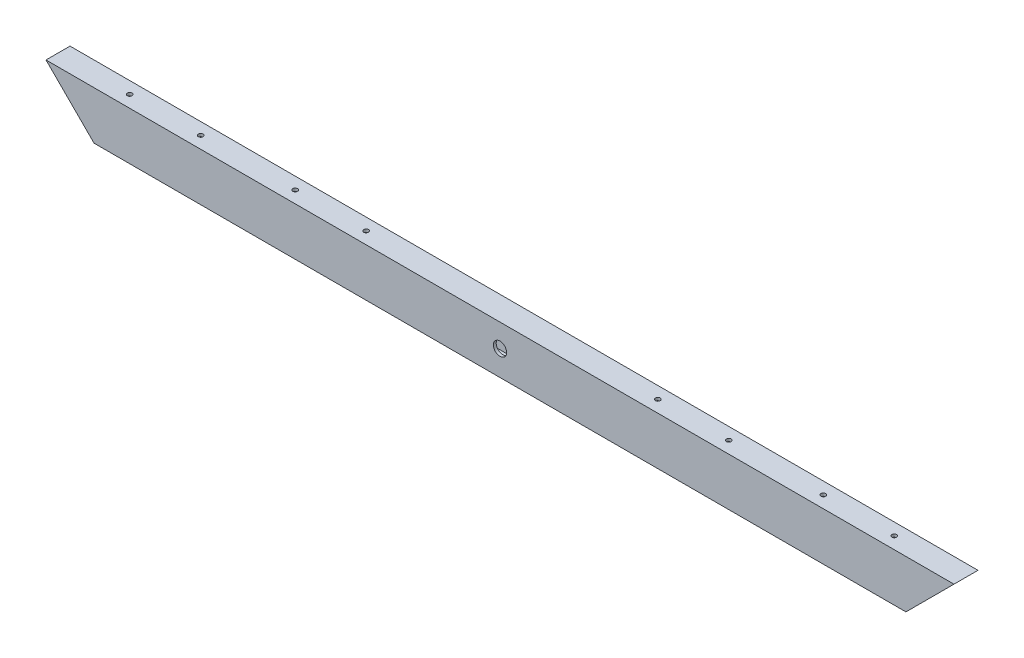
ISO-10303-21;
HEADER;
FILE_DESCRIPTION(('STEP AP214'),'2;1');
FILE_NAME('part.step','',(''),(''),'','','');
FILE_SCHEMA(('AUTOMOTIVE_DESIGN { 1 0 10303 214 1 1 1 1 }'));
ENDSEC;
DATA;
#1=APPLICATION_CONTEXT('core data for automotive mechanical design processes');
#2=APPLICATION_PROTOCOL_DEFINITION('international standard','automotive_design',2000,#1);
#3=PRODUCT_CONTEXT('',#1,'mechanical');
#4=PRODUCT('Part','Part','',(#3));
#5=PRODUCT_RELATED_PRODUCT_CATEGORY('part','',(#4));
#6=PRODUCT_DEFINITION_FORMATION('','',#4);
#7=PRODUCT_DEFINITION_CONTEXT('part definition',#1,'design');
#8=PRODUCT_DEFINITION('design','',#6,#7);
#9=PRODUCT_DEFINITION_SHAPE('','',#8);
#10=(LENGTH_UNIT() NAMED_UNIT(*) SI_UNIT(.MILLI.,.METRE.));
#11=(NAMED_UNIT(*) PLANE_ANGLE_UNIT() SI_UNIT($,.RADIAN.));
#12=(NAMED_UNIT(*) SI_UNIT($,.STERADIAN.) SOLID_ANGLE_UNIT());
#13=UNCERTAINTY_MEASURE_WITH_UNIT(LENGTH_MEASURE(1.E-05),#10,'distance_accuracy_value','');
#14=(GEOMETRIC_REPRESENTATION_CONTEXT(3) GLOBAL_UNCERTAINTY_ASSIGNED_CONTEXT((#13)) GLOBAL_UNIT_ASSIGNED_CONTEXT((#10,
#11,#12)) REPRESENTATION_CONTEXT('',''));
#15=CARTESIAN_POINT('',(0.,0.,0.));
#16=DIRECTION('',(0.,0.,1.));
#17=DIRECTION('',(1.,0.,0.));
#18=AXIS2_PLACEMENT_3D('',#15,#16,#17);
#19=CARTESIAN_POINT('',(909.199999999999,50.8000000000002,25.4));
#20=DIRECTION('',(-0.707106781186554,0.707106781186541,0.));
#21=DIRECTION('',(-0.707106781186541,-0.707106781186554,0.));
#22=AXIS2_PLACEMENT_3D('',#19,#20,#21);
#23=PLANE('',#22);
#24=DIRECTION('',(0.707106781186541,0.707106781186554,0.));
#25=VECTOR('',#24,1.);
#26=CARTESIAN_POINT('',(909.199999999999,50.8000000000002,0.));
#27=LINE('',#26,#25);
#28=CARTESIAN_POINT('',(858.399999999999,0.,0.));
#29=VERTEX_POINT('',#28);
#30=CARTESIAN_POINT('',(909.199999999999,50.8000000000002,0.));
#31=VERTEX_POINT('',#30);
#32=EDGE_CURVE('E138',#29,#31,#27,.T.);
#33=ORIENTED_EDGE('',*,*,#32,.T.);
#34=DIRECTION('',(0.,0.,-1.));
#35=VECTOR('',#34,1.);
#36=CARTESIAN_POINT('',(909.199999999999,50.8000000000002,25.4));
#37=LINE('',#36,#35);
#38=CARTESIAN_POINT('',(909.199999999999,50.8000000000002,25.4));
#39=VERTEX_POINT('',#38);
#40=EDGE_CURVE('E167',#39,#31,#37,.T.);
#41=ORIENTED_EDGE('',*,*,#40,.F.);
#42=DIRECTION('',(0.707106781186541,0.707106781186554,0.));
#43=VECTOR('',#42,1.);
#44=CARTESIAN_POINT('',(909.199999999999,50.8000000000002,25.4));
#45=LINE('',#44,#43);
#46=CARTESIAN_POINT('',(858.399999999999,0.,25.4));
#47=VERTEX_POINT('',#46);
#48=EDGE_CURVE('E141',#47,#39,#45,.T.);
#49=ORIENTED_EDGE('',*,*,#48,.F.);
#50=DIRECTION('',(0.,0.,-1.));
#51=VECTOR('',#50,1.);
#52=CARTESIAN_POINT('',(858.399999999999,0.,25.4));
#53=LINE('',#52,#51);
#54=EDGE_CURVE('E151',#47,#29,#53,.T.);
#55=ORIENTED_EDGE('',*,*,#54,.T.);
#56=EDGE_LOOP('',(#33,#41,#49,#55));
#57=FACE_BOUND('',#56,.T.);
#58=DIRECTION('',(-0.707106781186541,-0.707106781186554,0.));
#59=VECTOR('',#58,1.);
#60=CARTESIAN_POINT('',(909.199999999999,50.8000000000002,22.4));
#61=LINE('',#60,#59);
#62=CARTESIAN_POINT('',(906.199999999999,47.8000000000002,22.4));
#63=VERTEX_POINT('',#62);
#64=CARTESIAN_POINT('',(861.399999999999,3.00000000000001,22.4));
#65=VERTEX_POINT('',#64);
#66=EDGE_CURVE('E132',#63,#65,#61,.T.);
#67=ORIENTED_EDGE('',*,*,#66,.F.);
#68=DIRECTION('',(0.,0.,1.));
#69=VECTOR('',#68,1.);
#70=CARTESIAN_POINT('',(906.199999999999,47.8000000000002,25.4));
#71=LINE('',#70,#69);
#72=CARTESIAN_POINT('',(906.199999999999,47.8000000000002,3.));
#73=VERTEX_POINT('',#72);
#74=EDGE_CURVE('E113',#73,#63,#71,.T.);
#75=ORIENTED_EDGE('',*,*,#74,.F.);
#76=DIRECTION('',(0.707106781186541,0.707106781186554,0.));
#77=VECTOR('',#76,1.);
#78=CARTESIAN_POINT('',(909.199999999999,50.8000000000002,3.));
#79=LINE('',#78,#77);
#80=CARTESIAN_POINT('',(861.399999999999,2.99999999999999,2.99999999999999));
#81=VERTEX_POINT('',#80);
#82=EDGE_CURVE('E117',#81,#73,#79,.T.);
#83=ORIENTED_EDGE('',*,*,#82,.F.);
#84=DIRECTION('',(0.,0.,-1.));
#85=VECTOR('',#84,1.);
#86=CARTESIAN_POINT('',(861.399999999999,3.00000000000001,25.4));
#87=LINE('',#86,#85);
#88=EDGE_CURVE('E102',#65,#81,#87,.T.);
#89=ORIENTED_EDGE('',*,*,#88,.F.);
#90=EDGE_LOOP('',(#67,#75,#83,#89));
#91=FACE_BOUND('',#90,.T.);
#92=ADVANCED_FACE('F37',(#57,#91),#23,.F.);
#93=CARTESIAN_POINT('',(-50.8000000000013,50.8,25.4));
#94=DIRECTION('',(0.707106781186539,0.707106781186556,0.));
#95=DIRECTION('',(-0.707106781186556,0.707106781186539,0.));
#96=AXIS2_PLACEMENT_3D('',#93,#94,#95);
#97=PLANE('',#96);
#98=DIRECTION('',(0.707106781186556,-0.707106781186539,0.));
#99=VECTOR('',#98,1.);
#100=CARTESIAN_POINT('',(-50.8000000000013,50.8,0.));
#101=LINE('',#100,#99);
#102=CARTESIAN_POINT('',(-50.8000000000013,50.8,0.));
#103=VERTEX_POINT('',#102);
#104=CARTESIAN_POINT('',(0.,0.,0.));
#105=VERTEX_POINT('',#104);
#106=EDGE_CURVE('E156',#103,#105,#101,.T.);
#107=ORIENTED_EDGE('',*,*,#106,.T.);
#108=DIRECTION('',(0.,0.,-1.));
#109=VECTOR('',#108,1.);
#110=CARTESIAN_POINT('',(0.,0.,25.4));
#111=LINE('',#110,#109);
#112=CARTESIAN_POINT('',(0.,0.,25.4));
#113=VERTEX_POINT('',#112);
#114=EDGE_CURVE('E161',#113,#105,#111,.T.);
#115=ORIENTED_EDGE('',*,*,#114,.F.);
#116=DIRECTION('',(0.707106781186556,-0.707106781186539,0.));
#117=VECTOR('',#116,1.);
#118=CARTESIAN_POINT('',(-50.8000000000013,50.8,25.4));
#119=LINE('',#118,#117);
#120=CARTESIAN_POINT('',(-50.8000000000013,50.8,25.4));
#121=VERTEX_POINT('',#120);
#122=EDGE_CURVE('E147',#121,#113,#119,.T.);
#123=ORIENTED_EDGE('',*,*,#122,.F.);
#124=DIRECTION('',(0.,0.,-1.));
#125=VECTOR('',#124,1.);
#126=CARTESIAN_POINT('',(-50.8000000000013,50.8,25.4));
#127=LINE('',#126,#125);
#128=EDGE_CURVE('E164',#121,#103,#127,.T.);
#129=ORIENTED_EDGE('',*,*,#128,.T.);
#130=EDGE_LOOP('',(#107,#115,#123,#129));
#131=FACE_BOUND('',#130,.T.);
#132=DIRECTION('',(-0.707106781186556,0.707106781186539,0.));
#133=VECTOR('',#132,1.);
#134=CARTESIAN_POINT('',(-50.8000000000013,50.8,22.4));
#135=LINE('',#134,#133);
#136=CARTESIAN_POINT('',(-3.00000000000011,3.00000000000001,22.4));
#137=VERTEX_POINT('',#136);
#138=CARTESIAN_POINT('',(-47.8000000000014,47.8000000000002,22.4));
#139=VERTEX_POINT('',#138);
#140=EDGE_CURVE('E125',#137,#139,#135,.T.);
#141=ORIENTED_EDGE('',*,*,#140,.F.);
#142=DIRECTION('',(0.,0.,1.));
#143=VECTOR('',#142,1.);
#144=CARTESIAN_POINT('',(-3.00000000000007,3.,25.4));
#145=LINE('',#144,#143);
#146=CARTESIAN_POINT('',(-3.0000000000001,3.00000000000002,2.99999999999999));
#147=VERTEX_POINT('',#146);
#148=EDGE_CURVE('E11',#147,#137,#145,.T.);
#149=ORIENTED_EDGE('',*,*,#148,.F.);
#150=DIRECTION('',(0.707106781186556,-0.707106781186539,0.));
#151=VECTOR('',#150,1.);
#152=CARTESIAN_POINT('',(-50.8000000000013,50.8,3.));
#153=LINE('',#152,#151);
#154=CARTESIAN_POINT('',(-47.8000000000014,47.8000000000002,3.));
#155=VERTEX_POINT('',#154);
#156=EDGE_CURVE('E120',#155,#147,#153,.T.);
#157=ORIENTED_EDGE('',*,*,#156,.F.);
#158=DIRECTION('',(0.,0.,-1.));
#159=VECTOR('',#158,1.);
#160=CARTESIAN_POINT('',(-47.8000000000014,47.8000000000002,25.4));
#161=LINE('',#160,#159);
#162=EDGE_CURVE('E45',#139,#155,#161,.T.);
#163=ORIENTED_EDGE('',*,*,#162,.F.);
#164=EDGE_LOOP('',(#141,#149,#157,#163));
#165=FACE_BOUND('',#164,.T.);
#166=ADVANCED_FACE('F219',(#131,#165),#97,.F.);
#167=CARTESIAN_POINT('',(429.199999999999,26.4000000000001,25.4));
#168=DIRECTION('',(0.,0.,-1.));
#169=DIRECTION('',(-1.,0.,0.));
#170=AXIS2_PLACEMENT_3D('',#167,#168,#169);
#171=CYLINDRICAL_SURFACE('',#170,6.99999999999999);
#172=CARTESIAN_POINT('',(429.199999999999,26.4000000000001,25.4));
#173=DIRECTION('',(0.,0.,1.));
#174=DIRECTION('',(1.,0.,0.));
#175=AXIS2_PLACEMENT_3D('',#172,#173,#174);
#176=CIRCLE('',#175,6.99999999999999);
#177=CARTESIAN_POINT('',(436.199999999999,26.4000000000001,25.4));
#178=VERTEX_POINT('',#177);
#179=EDGE_CURVE('E135',#178,#178,#176,.T.);
#180=ORIENTED_EDGE('',*,*,#179,.T.);
#181=EDGE_LOOP('',(#180));
#182=FACE_BOUND('',#181,.T.);
#183=CARTESIAN_POINT('',(429.199999999999,26.4000000000001,22.4));
#184=DIRECTION('',(0.,0.,-1.));
#185=DIRECTION('',(0.,1.,0.));
#186=AXIS2_PLACEMENT_3D('',#183,#184,#185);
#187=CIRCLE('',#186,6.99999999999999);
#188=CARTESIAN_POINT('',(429.199999999999,33.4000000000001,22.4));
#189=VERTEX_POINT('',#188);
#190=EDGE_CURVE('E122',#189,#189,#187,.T.);
#191=ORIENTED_EDGE('',*,*,#190,.T.);
#192=EDGE_LOOP('',(#191));
#193=FACE_BOUND('',#192,.T.);
#194=ADVANCED_FACE('F240',(#182,#193),#171,.F.);
#195=CARTESIAN_POINT('',(429.199999999999,26.4000000000001,0.));
#196=DIRECTION('',(0.,0.,1.));
#197=DIRECTION('',(1.,0.,0.));
#198=AXIS2_PLACEMENT_3D('',#195,#196,#197);
#199=CIRCLE('',#198,6.99999999999999);
#200=CARTESIAN_POINT('',(436.199999999999,26.4000000000001,0.));
#201=VERTEX_POINT('',#200);
#202=EDGE_CURVE('E112',#201,#201,#199,.T.);
#203=ORIENTED_EDGE('',*,*,#202,.F.);
#204=EDGE_LOOP('',(#203));
#205=FACE_BOUND('',#204,.T.);
#206=CARTESIAN_POINT('',(429.199999999999,26.4000000000001,3.));
#207=DIRECTION('',(0.,0.,1.));
#208=DIRECTION('',(0.,-1.,0.));
#209=AXIS2_PLACEMENT_3D('',#206,#207,#208);
#210=CIRCLE('',#209,6.99999999999999);
#211=CARTESIAN_POINT('',(429.199999999999,19.4000000000001,2.99999999999999));
#212=VERTEX_POINT('',#211);
#213=EDGE_CURVE('E127',#212,#212,#210,.T.);
#214=ORIENTED_EDGE('',*,*,#213,.T.);
#215=EDGE_LOOP('',(#214));
#216=FACE_BOUND('',#215,.T.);
#217=ADVANCED_FACE('F273',(#205,#216),#171,.F.);
#218=CARTESIAN_POINT('',(0.,0.,25.4));
#219=DIRECTION('',(0.,0.,1.));
#220=DIRECTION('',(1.,0.,0.));
#221=AXIS2_PLACEMENT_3D('',#218,#219,#220);
#222=PLANE('',#221);
#223=ORIENTED_EDGE('',*,*,#48,.T.);
#224=DIRECTION('',(-1.,0.,0.));
#225=VECTOR('',#224,1.);
#226=CARTESIAN_POINT('',(-50.8000000000013,50.8,25.4));
#227=LINE('',#226,#225);
#228=EDGE_CURVE('E144',#39,#121,#227,.T.);
#229=ORIENTED_EDGE('',*,*,#228,.T.);
#230=ORIENTED_EDGE('',*,*,#122,.T.);
#231=DIRECTION('',(1.,0.,0.));
#232=VECTOR('',#231,1.);
#233=CARTESIAN_POINT('',(0.,0.,25.4));
#234=LINE('',#233,#232);
#235=EDGE_CURVE('E149',#113,#47,#234,.T.);
#236=ORIENTED_EDGE('',*,*,#235,.T.);
#237=EDGE_LOOP('',(#223,#229,#230,#236));
#238=FACE_BOUND('',#237,.T.);
#239=ORIENTED_EDGE('',*,*,#179,.F.);
#240=EDGE_LOOP('',(#239));
#241=FACE_BOUND('',#240,.T.);
#242=ADVANCED_FACE('F257',(#238,#241),#222,.T.);
#243=CARTESIAN_POINT('',(0.,0.,0.));
#244=DIRECTION('',(0.,0.,1.));
#245=DIRECTION('',(1.,0.,0.));
#246=AXIS2_PLACEMENT_3D('',#243,#244,#245);
#247=PLANE('',#246);
#248=ORIENTED_EDGE('',*,*,#32,.F.);
#249=DIRECTION('',(1.,0.,0.));
#250=VECTOR('',#249,1.);
#251=CARTESIAN_POINT('',(0.,0.,0.));
#252=LINE('',#251,#250);
#253=EDGE_CURVE('E145',#105,#29,#252,.T.);
#254=ORIENTED_EDGE('',*,*,#253,.F.);
#255=ORIENTED_EDGE('',*,*,#106,.F.);
#256=DIRECTION('',(-1.,0.,0.));
#257=VECTOR('',#256,1.);
#258=CARTESIAN_POINT('',(-50.8000000000013,50.8,0.));
#259=LINE('',#258,#257);
#260=EDGE_CURVE('E154',#31,#103,#259,.T.);
#261=ORIENTED_EDGE('',*,*,#260,.F.);
#262=EDGE_LOOP('',(#248,#254,#255,#261));
#263=FACE_BOUND('',#262,.T.);
#264=ORIENTED_EDGE('',*,*,#202,.T.);
#265=EDGE_LOOP('',(#264));
#266=FACE_BOUND('',#265,.T.);
#267=ADVANCED_FACE('F249',(#263,#266),#247,.F.);
#268=CARTESIAN_POINT('',(-50.8000000000013,50.8,25.4));
#269=DIRECTION('',(0.,-1.,0.));
#270=DIRECTION('',(1.,0.,0.));
#271=AXIS2_PLACEMENT_3D('',#268,#269,#270);
#272=PLANE('',#271);
#273=CARTESIAN_POINT('',(24.9999999999987,50.8,12.7));
#274=DIRECTION('',(0.,-1.,0.));
#275=DIRECTION('',(1.,0.,0.));
#276=AXIS2_PLACEMENT_3D('',#273,#274,#275);
#277=CIRCLE('',#276,2.5);
#278=CARTESIAN_POINT('',(27.4999999999987,50.8,12.7));
#279=VERTEX_POINT('',#278);
#280=EDGE_CURVE('E210',#279,#279,#277,.F.);
#281=ORIENTED_EDGE('',*,*,#280,.F.);
#282=EDGE_LOOP('',(#281));
#283=FACE_BOUND('',#282,.T.);
#284=CARTESIAN_POINT('',(583.399999999999,50.8000000000002,12.7));
#285=DIRECTION('',(0.,-1.,0.));
#286=DIRECTION('',(1.,0.,0.));
#287=AXIS2_PLACEMENT_3D('',#284,#285,#286);
#288=CIRCLE('',#287,2.49999999999991);
#289=CARTESIAN_POINT('',(585.899999999999,50.8000000000002,12.7));
#290=VERTEX_POINT('',#289);
#291=EDGE_CURVE('E198',#290,#290,#288,.F.);
#292=ORIENTED_EDGE('',*,*,#291,.F.);
#293=EDGE_LOOP('',(#292));
#294=FACE_BOUND('',#293,.T.);
#295=CARTESIAN_POINT('',(658.399999999999,50.8000000000002,12.7));
#296=DIRECTION('',(0.,-1.,0.));
#297=DIRECTION('',(1.,0.,0.));
#298=AXIS2_PLACEMENT_3D('',#295,#296,#297);
#299=CIRCLE('',#298,2.49999999999991);
#300=CARTESIAN_POINT('',(660.899999999999,50.8000000000002,12.7));
#301=VERTEX_POINT('',#300);
#302=EDGE_CURVE('E195',#301,#301,#299,.F.);
#303=ORIENTED_EDGE('',*,*,#302,.F.);
#304=EDGE_LOOP('',(#303));
#305=FACE_BOUND('',#304,.T.);
#306=CARTESIAN_POINT('',(758.399999999999,50.8000000000002,12.7));
#307=DIRECTION('',(0.,-1.,0.));
#308=DIRECTION('',(1.,0.,0.));
#309=AXIS2_PLACEMENT_3D('',#306,#307,#308);
#310=CIRCLE('',#309,2.49999999999991);
#311=CARTESIAN_POINT('',(760.899999999999,50.8000000000002,12.7));
#312=VERTEX_POINT('',#311);
#313=EDGE_CURVE('E192',#312,#312,#310,.F.);
#314=ORIENTED_EDGE('',*,*,#313,.F.);
#315=EDGE_LOOP('',(#314));
#316=FACE_BOUND('',#315,.T.);
#317=CARTESIAN_POINT('',(833.399999999999,50.8000000000002,12.7));
#318=DIRECTION('',(0.,-1.,0.));
#319=DIRECTION('',(1.,0.,0.));
#320=AXIS2_PLACEMENT_3D('',#317,#318,#319);
#321=CIRCLE('',#320,2.49999999999991);
#322=CARTESIAN_POINT('',(835.899999999999,50.8000000000002,12.7));
#323=VERTEX_POINT('',#322);
#324=EDGE_CURVE('E188',#323,#323,#321,.F.);
#325=ORIENTED_EDGE('',*,*,#324,.F.);
#326=EDGE_LOOP('',(#325));
#327=FACE_BOUND('',#326,.T.);
#328=CARTESIAN_POINT('',(274.999999999999,50.8000000000001,12.7));
#329=DIRECTION('',(0.,-1.,0.));
#330=DIRECTION('',(1.,0.,0.));
#331=AXIS2_PLACEMENT_3D('',#328,#329,#330);
#332=CIRCLE('',#331,2.50000000000002);
#333=CARTESIAN_POINT('',(277.499999999999,50.8000000000001,12.7));
#334=VERTEX_POINT('',#333);
#335=EDGE_CURVE('E184',#334,#334,#332,.F.);
#336=ORIENTED_EDGE('',*,*,#335,.F.);
#337=EDGE_LOOP('',(#336));
#338=FACE_BOUND('',#337,.T.);
#339=CARTESIAN_POINT('',(199.999999999999,50.8000000000001,12.7));
#340=DIRECTION('',(0.,-1.,0.));
#341=DIRECTION('',(1.,0.,0.));
#342=AXIS2_PLACEMENT_3D('',#339,#340,#341);
#343=CIRCLE('',#342,2.5);
#344=CARTESIAN_POINT('',(202.499999999999,50.8000000000001,12.7));
#345=VERTEX_POINT('',#344);
#346=EDGE_CURVE('E180',#345,#345,#343,.F.);
#347=ORIENTED_EDGE('',*,*,#346,.F.);
#348=EDGE_LOOP('',(#347));
#349=FACE_BOUND('',#348,.T.);
#350=CARTESIAN_POINT('',(99.9999999999987,50.8,12.7));
#351=DIRECTION('',(0.,-1.,0.));
#352=DIRECTION('',(1.,0.,0.));
#353=AXIS2_PLACEMENT_3D('',#350,#351,#352);
#354=CIRCLE('',#353,2.5);
#355=CARTESIAN_POINT('',(102.499999999999,50.8,12.7));
#356=VERTEX_POINT('',#355);
#357=EDGE_CURVE('E176',#356,#356,#354,.F.);
#358=ORIENTED_EDGE('',*,*,#357,.F.);
#359=EDGE_LOOP('',(#358));
#360=FACE_BOUND('',#359,.T.);
#361=ORIENTED_EDGE('',*,*,#260,.T.);
#362=ORIENTED_EDGE('',*,*,#128,.F.);
#363=ORIENTED_EDGE('',*,*,#228,.F.);
#364=ORIENTED_EDGE('',*,*,#40,.T.);
#365=EDGE_LOOP('',(#361,#362,#363,#364));
#366=FACE_BOUND('',#365,.T.);
#367=ADVANCED_FACE('F254',(#283,#294,#305,#316,#327,#338,#349,#360,#366),#272,.F.);
#368=CARTESIAN_POINT('',(0.,0.,25.4));
#369=DIRECTION('',(0.,1.,0.));
#370=DIRECTION('',(-1.,0.,0.));
#371=AXIS2_PLACEMENT_3D('',#368,#369,#370);
#372=PLANE('',#371);
#373=ORIENTED_EDGE('',*,*,#253,.T.);
#374=ORIENTED_EDGE('',*,*,#54,.F.);
#375=ORIENTED_EDGE('',*,*,#235,.F.);
#376=ORIENTED_EDGE('',*,*,#114,.T.);
#377=EDGE_LOOP('',(#373,#374,#375,#376));
#378=FACE_BOUND('',#377,.T.);
#379=ADVANCED_FACE('F230',(#378),#372,.F.);
#380=CARTESIAN_POINT('',(1046.4,3.00000000000001,22.4));
#381=DIRECTION('',(0.,1.,0.));
#382=DIRECTION('',(0.,0.,1.));
#383=AXIS2_PLACEMENT_3D('',#380,#381,#382);
#384=PLANE('',#383);
#385=ORIENTED_EDGE('',*,*,#88,.T.);
#386=DIRECTION('',(-1.,0.,0.));
#387=VECTOR('',#386,1.);
#388=CARTESIAN_POINT('',(1046.4,3.00000000000001,2.99999999999999));
#389=LINE('',#388,#387);
#390=EDGE_CURVE('E105',#81,#147,#389,.T.);
#391=ORIENTED_EDGE('',*,*,#390,.T.);
#392=ORIENTED_EDGE('',*,*,#148,.T.);
#393=DIRECTION('',(-1.,0.,0.));
#394=VECTOR('',#393,1.);
#395=CARTESIAN_POINT('',(1046.4,3.00000000000001,22.4));
#396=LINE('',#395,#394);
#397=EDGE_CURVE('E108',#65,#137,#396,.T.);
#398=ORIENTED_EDGE('',*,*,#397,.F.);
#399=EDGE_LOOP('',(#385,#391,#392,#398));
#400=FACE_BOUND('',#399,.T.);
#401=ADVANCED_FACE('F104',(#400),#384,.T.);
#402=CARTESIAN_POINT('',(1046.4,47.8000000000002,22.4));
#403=DIRECTION('',(0.,-1.,0.));
#404=DIRECTION('',(0.,0.,-1.));
#405=AXIS2_PLACEMENT_3D('',#402,#403,#404);
#406=PLANE('',#405);
#407=CARTESIAN_POINT('',(24.9999999999987,47.8000000000002,12.7));
#408=DIRECTION('',(0.,-1.,0.));
#409=DIRECTION('',(0.,0.,-1.));
#410=AXIS2_PLACEMENT_3D('',#407,#408,#409);
#411=CIRCLE('',#410,2.5);
#412=CARTESIAN_POINT('',(24.9999999999987,47.8000000000002,10.2));
#413=VERTEX_POINT('',#412);
#414=EDGE_CURVE('E40',#413,#413,#411,.F.);
#415=ORIENTED_EDGE('',*,*,#414,.T.);
#416=EDGE_LOOP('',(#415));
#417=FACE_BOUND('',#416,.T.);
#418=CARTESIAN_POINT('',(583.399999999999,47.8000000000002,12.7));
#419=DIRECTION('',(0.,-1.,0.));
#420=DIRECTION('',(0.,0.,-1.));
#421=AXIS2_PLACEMENT_3D('',#418,#419,#420);
#422=CIRCLE('',#421,2.49999999999991);
#423=CARTESIAN_POINT('',(583.399999999999,47.8000000000002,10.2000000000001));
#424=VERTEX_POINT('',#423);
#425=EDGE_CURVE('E196',#424,#424,#422,.F.);
#426=ORIENTED_EDGE('',*,*,#425,.T.);
#427=EDGE_LOOP('',(#426));
#428=FACE_BOUND('',#427,.T.);
#429=CARTESIAN_POINT('',(658.399999999999,47.8000000000002,12.7));
#430=DIRECTION('',(0.,-1.,0.));
#431=DIRECTION('',(0.,0.,-1.));
#432=AXIS2_PLACEMENT_3D('',#429,#430,#431);
#433=CIRCLE('',#432,2.49999999999991);
#434=CARTESIAN_POINT('',(658.399999999999,47.8000000000002,10.2000000000001));
#435=VERTEX_POINT('',#434);
#436=EDGE_CURVE('E193',#435,#435,#433,.F.);
#437=ORIENTED_EDGE('',*,*,#436,.T.);
#438=EDGE_LOOP('',(#437));
#439=FACE_BOUND('',#438,.T.);
#440=CARTESIAN_POINT('',(758.399999999999,47.8000000000002,12.7));
#441=DIRECTION('',(0.,-1.,0.));
#442=DIRECTION('',(0.,0.,-1.));
#443=AXIS2_PLACEMENT_3D('',#440,#441,#442);
#444=CIRCLE('',#443,2.49999999999991);
#445=CARTESIAN_POINT('',(758.399999999999,47.8000000000002,10.2000000000001));
#446=VERTEX_POINT('',#445);
#447=EDGE_CURVE('E189',#446,#446,#444,.F.);
#448=ORIENTED_EDGE('',*,*,#447,.T.);
#449=EDGE_LOOP('',(#448));
#450=FACE_BOUND('',#449,.T.);
#451=CARTESIAN_POINT('',(833.399999999999,47.8000000000002,12.7));
#452=DIRECTION('',(0.,-1.,0.));
#453=DIRECTION('',(0.,0.,-1.));
#454=AXIS2_PLACEMENT_3D('',#451,#452,#453);
#455=CIRCLE('',#454,2.49999999999991);
#456=CARTESIAN_POINT('',(833.399999999999,47.8000000000002,10.2000000000001));
#457=VERTEX_POINT('',#456);
#458=EDGE_CURVE('E185',#457,#457,#455,.F.);
#459=ORIENTED_EDGE('',*,*,#458,.T.);
#460=EDGE_LOOP('',(#459));
#461=FACE_BOUND('',#460,.T.);
#462=CARTESIAN_POINT('',(274.999999999999,47.8000000000002,12.7));
#463=DIRECTION('',(0.,-1.,0.));
#464=DIRECTION('',(0.,0.,-1.));
#465=AXIS2_PLACEMENT_3D('',#462,#463,#464);
#466=CIRCLE('',#465,2.50000000000002);
#467=CARTESIAN_POINT('',(274.999999999999,47.8000000000002,10.2));
#468=VERTEX_POINT('',#467);
#469=EDGE_CURVE('E181',#468,#468,#466,.F.);
#470=ORIENTED_EDGE('',*,*,#469,.T.);
#471=EDGE_LOOP('',(#470));
#472=FACE_BOUND('',#471,.T.);
#473=CARTESIAN_POINT('',(199.999999999999,47.8000000000002,12.7));
#474=DIRECTION('',(0.,-1.,0.));
#475=DIRECTION('',(0.,0.,-1.));
#476=AXIS2_PLACEMENT_3D('',#473,#474,#475);
#477=CIRCLE('',#476,2.5);
#478=CARTESIAN_POINT('',(199.999999999999,47.8000000000002,10.2));
#479=VERTEX_POINT('',#478);
#480=EDGE_CURVE('E177',#479,#479,#477,.F.);
#481=ORIENTED_EDGE('',*,*,#480,.T.);
#482=EDGE_LOOP('',(#481));
#483=FACE_BOUND('',#482,.T.);
#484=CARTESIAN_POINT('',(99.9999999999987,47.8000000000002,12.7));
#485=DIRECTION('',(0.,-1.,0.));
#486=DIRECTION('',(0.,0.,-1.));
#487=AXIS2_PLACEMENT_3D('',#484,#485,#486);
#488=CIRCLE('',#487,2.5);
#489=CARTESIAN_POINT('',(99.9999999999987,47.8000000000002,10.2));
#490=VERTEX_POINT('',#489);
#491=EDGE_CURVE('E173',#490,#490,#488,.F.);
#492=ORIENTED_EDGE('',*,*,#491,.T.);
#493=EDGE_LOOP('',(#492));
#494=FACE_BOUND('',#493,.T.);
#495=ORIENTED_EDGE('',*,*,#74,.T.);
#496=DIRECTION('',(-1.,0.,0.));
#497=VECTOR('',#496,1.);
#498=CARTESIAN_POINT('',(1046.4,47.8000000000002,22.4));
#499=LINE('',#498,#497);
#500=EDGE_CURVE('E58',#63,#139,#499,.T.);
#501=ORIENTED_EDGE('',*,*,#500,.T.);
#502=ORIENTED_EDGE('',*,*,#162,.T.);
#503=DIRECTION('',(-1.,0.,0.));
#504=VECTOR('',#503,1.);
#505=CARTESIAN_POINT('',(1046.4,47.8000000000002,3.));
#506=LINE('',#505,#504);
#507=EDGE_CURVE('E53',#73,#155,#506,.T.);
#508=ORIENTED_EDGE('',*,*,#507,.F.);
#509=EDGE_LOOP('',(#495,#501,#502,#508));
#510=FACE_BOUND('',#509,.T.);
#511=ADVANCED_FACE('F220',(#417,#428,#439,#450,#461,#472,#483,#494,#510),#406,.T.);
#512=CARTESIAN_POINT('',(1046.4,47.8000000000002,22.4));
#513=DIRECTION('',(0.,0.,-1.));
#514=DIRECTION('',(0.,1.,0.));
#515=AXIS2_PLACEMENT_3D('',#512,#513,#514);
#516=PLANE('',#515);
#517=ORIENTED_EDGE('',*,*,#190,.F.);
#518=EDGE_LOOP('',(#517));
#519=FACE_BOUND('',#518,.T.);
#520=ORIENTED_EDGE('',*,*,#66,.T.);
#521=ORIENTED_EDGE('',*,*,#397,.T.);
#522=ORIENTED_EDGE('',*,*,#140,.T.);
#523=ORIENTED_EDGE('',*,*,#500,.F.);
#524=EDGE_LOOP('',(#520,#521,#522,#523));
#525=FACE_BOUND('',#524,.T.);
#526=ADVANCED_FACE('F216',(#519,#525),#516,.T.);
#527=CARTESIAN_POINT('',(1046.4,47.8000000000002,3.));
#528=DIRECTION('',(0.,0.,1.));
#529=DIRECTION('',(0.,-1.,0.));
#530=AXIS2_PLACEMENT_3D('',#527,#528,#529);
#531=PLANE('',#530);
#532=ORIENTED_EDGE('',*,*,#213,.F.);
#533=EDGE_LOOP('',(#532));
#534=FACE_BOUND('',#533,.T.);
#535=ORIENTED_EDGE('',*,*,#82,.T.);
#536=ORIENTED_EDGE('',*,*,#507,.T.);
#537=ORIENTED_EDGE('',*,*,#156,.T.);
#538=ORIENTED_EDGE('',*,*,#390,.F.);
#539=EDGE_LOOP('',(#535,#536,#537,#538));
#540=FACE_BOUND('',#539,.T.);
#541=ADVANCED_FACE('F116',(#534,#540),#531,.T.);
#542=CARTESIAN_POINT('',(99.9999999999987,72.8,12.7));
#543=DIRECTION('',(0.,-1.,0.));
#544=DIRECTION('',(1.,0.,0.));
#545=AXIS2_PLACEMENT_3D('',#542,#543,#544);
#546=CYLINDRICAL_SURFACE('',#545,2.5);
#547=ORIENTED_EDGE('',*,*,#491,.F.);
#548=EDGE_LOOP('',(#547));
#549=FACE_BOUND('',#548,.T.);
#550=ORIENTED_EDGE('',*,*,#357,.T.);
#551=EDGE_LOOP('',(#550));
#552=FACE_BOUND('',#551,.T.);
#553=ADVANCED_FACE('F277',(#549,#552),#546,.F.);
#554=CARTESIAN_POINT('',(199.999999999999,72.8000000000001,12.7));
#555=DIRECTION('',(0.,-1.,0.));
#556=DIRECTION('',(1.,0.,0.));
#557=AXIS2_PLACEMENT_3D('',#554,#555,#556);
#558=CYLINDRICAL_SURFACE('',#557,2.5);
#559=ORIENTED_EDGE('',*,*,#480,.F.);
#560=EDGE_LOOP('',(#559));
#561=FACE_BOUND('',#560,.T.);
#562=ORIENTED_EDGE('',*,*,#346,.T.);
#563=EDGE_LOOP('',(#562));
#564=FACE_BOUND('',#563,.T.);
#565=ADVANCED_FACE('F282',(#561,#564),#558,.F.);
#566=CARTESIAN_POINT('',(274.999999999999,72.8000000000001,12.7));
#567=DIRECTION('',(0.,-1.,0.));
#568=DIRECTION('',(1.,0.,0.));
#569=AXIS2_PLACEMENT_3D('',#566,#567,#568);
#570=CYLINDRICAL_SURFACE('',#569,2.50000000000002);
#571=ORIENTED_EDGE('',*,*,#469,.F.);
#572=EDGE_LOOP('',(#571));
#573=FACE_BOUND('',#572,.T.);
#574=ORIENTED_EDGE('',*,*,#335,.T.);
#575=EDGE_LOOP('',(#574));
#576=FACE_BOUND('',#575,.T.);
#577=ADVANCED_FACE('F335',(#573,#576),#570,.F.);
#578=CARTESIAN_POINT('',(833.399999999999,72.8000000000002,12.7));
#579=DIRECTION('',(0.,-1.,0.));
#580=DIRECTION('',(1.,0.,0.));
#581=AXIS2_PLACEMENT_3D('',#578,#579,#580);
#582=CYLINDRICAL_SURFACE('',#581,2.49999999999991);
#583=ORIENTED_EDGE('',*,*,#458,.F.);
#584=EDGE_LOOP('',(#583));
#585=FACE_BOUND('',#584,.T.);
#586=ORIENTED_EDGE('',*,*,#324,.T.);
#587=EDGE_LOOP('',(#586));
#588=FACE_BOUND('',#587,.T.);
#589=ADVANCED_FACE('F346',(#585,#588),#582,.F.);
#590=CARTESIAN_POINT('',(758.399999999999,72.8000000000002,12.7));
#591=DIRECTION('',(0.,-1.,0.));
#592=DIRECTION('',(1.,0.,0.));
#593=AXIS2_PLACEMENT_3D('',#590,#591,#592);
#594=CYLINDRICAL_SURFACE('',#593,2.49999999999991);
#595=ORIENTED_EDGE('',*,*,#447,.F.);
#596=EDGE_LOOP('',(#595));
#597=FACE_BOUND('',#596,.T.);
#598=ORIENTED_EDGE('',*,*,#313,.T.);
#599=EDGE_LOOP('',(#598));
#600=FACE_BOUND('',#599,.T.);
#601=ADVANCED_FACE('F357',(#597,#600),#594,.F.);
#602=CARTESIAN_POINT('',(658.399999999999,72.8000000000002,12.7));
#603=DIRECTION('',(0.,-1.,0.));
#604=DIRECTION('',(1.,0.,0.));
#605=AXIS2_PLACEMENT_3D('',#602,#603,#604);
#606=CYLINDRICAL_SURFACE('',#605,2.49999999999991);
#607=ORIENTED_EDGE('',*,*,#436,.F.);
#608=EDGE_LOOP('',(#607));
#609=FACE_BOUND('',#608,.T.);
#610=ORIENTED_EDGE('',*,*,#302,.T.);
#611=EDGE_LOOP('',(#610));
#612=FACE_BOUND('',#611,.T.);
#613=ADVANCED_FACE('F367',(#609,#612),#606,.F.);
#614=CARTESIAN_POINT('',(583.399999999999,72.8000000000002,12.7));
#615=DIRECTION('',(0.,-1.,0.));
#616=DIRECTION('',(1.,0.,0.));
#617=AXIS2_PLACEMENT_3D('',#614,#615,#616);
#618=CYLINDRICAL_SURFACE('',#617,2.49999999999991);
#619=ORIENTED_EDGE('',*,*,#425,.F.);
#620=EDGE_LOOP('',(#619));
#621=FACE_BOUND('',#620,.T.);
#622=ORIENTED_EDGE('',*,*,#291,.T.);
#623=EDGE_LOOP('',(#622));
#624=FACE_BOUND('',#623,.T.);
#625=ADVANCED_FACE('F378',(#621,#624),#618,.F.);
#626=CARTESIAN_POINT('',(24.9999999999987,72.8,12.7));
#627=DIRECTION('',(0.,-1.,0.));
#628=DIRECTION('',(1.,0.,0.));
#629=AXIS2_PLACEMENT_3D('',#626,#627,#628);
#630=CYLINDRICAL_SURFACE('',#629,2.5);
#631=ORIENTED_EDGE('',*,*,#414,.F.);
#632=EDGE_LOOP('',(#631));
#633=FACE_BOUND('',#632,.T.);
#634=ORIENTED_EDGE('',*,*,#280,.T.);
#635=EDGE_LOOP('',(#634));
#636=FACE_BOUND('',#635,.T.);
#637=ADVANCED_FACE('F389',(#633,#636),#630,.F.);
#638=CLOSED_SHELL('',(#92,#166,#194,#217,#242,#267,#367,#379,#401,#511,#526,#541,#553,#565,#577,
#589,#601,#613,#625,#637));
#639=MANIFOLD_SOLID_BREP('B2',#638);
#640=ADVANCED_BREP_SHAPE_REPRESENTATION('',(#18,#639),#14);
#641=SHAPE_DEFINITION_REPRESENTATION(#9,#640);
ENDSEC;
END-ISO-10303-21;
